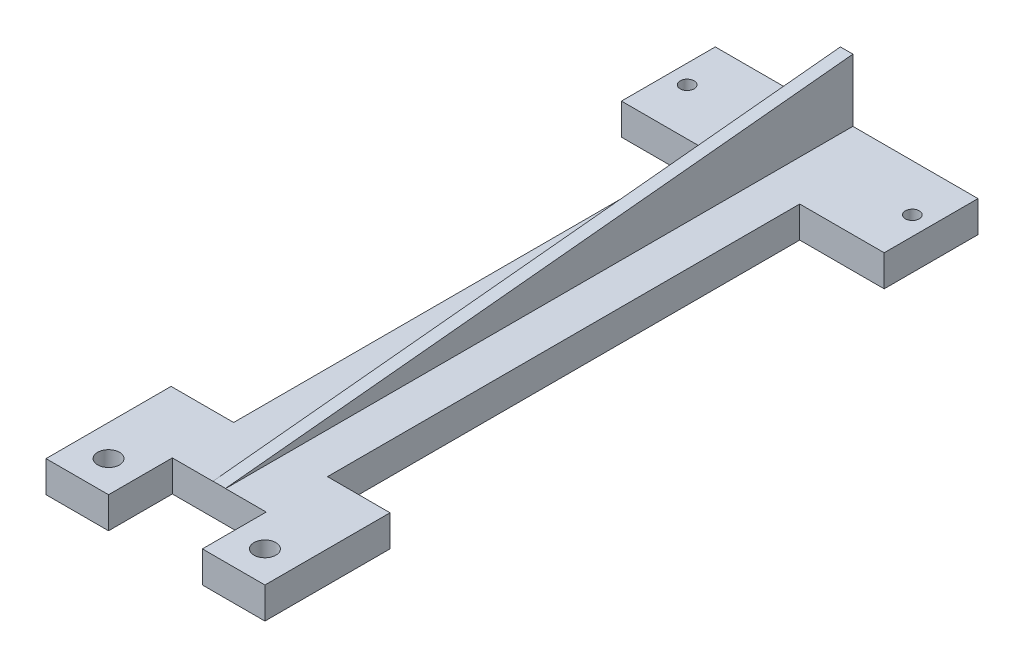
ISO-10303-21;
HEADER;
FILE_DESCRIPTION(('STEP AP214'),'2;1');
FILE_NAME('part.step','',(''),(''),'','','');
FILE_SCHEMA(('AUTOMOTIVE_DESIGN { 1 0 10303 214 1 1 1 1 }'));
ENDSEC;
DATA;
#1=APPLICATION_CONTEXT('core data for automotive mechanical design processes');
#2=APPLICATION_PROTOCOL_DEFINITION('international standard','automotive_design',2000,#1);
#3=PRODUCT_CONTEXT('',#1,'mechanical');
#4=PRODUCT('Part','Part','',(#3));
#5=PRODUCT_RELATED_PRODUCT_CATEGORY('part','',(#4));
#6=PRODUCT_DEFINITION_FORMATION('','',#4);
#7=PRODUCT_DEFINITION_CONTEXT('part definition',#1,'design');
#8=PRODUCT_DEFINITION('design','',#6,#7);
#9=PRODUCT_DEFINITION_SHAPE('','',#8);
#10=(LENGTH_UNIT() NAMED_UNIT(*) SI_UNIT(.MILLI.,.METRE.));
#11=(NAMED_UNIT(*) PLANE_ANGLE_UNIT() SI_UNIT($,.RADIAN.));
#12=(NAMED_UNIT(*) SI_UNIT($,.STERADIAN.) SOLID_ANGLE_UNIT());
#13=UNCERTAINTY_MEASURE_WITH_UNIT(LENGTH_MEASURE(1.E-05),#10,'distance_accuracy_value','');
#14=(GEOMETRIC_REPRESENTATION_CONTEXT(3) GLOBAL_UNCERTAINTY_ASSIGNED_CONTEXT((#13)) GLOBAL_UNIT_ASSIGNED_CONTEXT((#10,
#11,#12)) REPRESENTATION_CONTEXT('',''));
#15=CARTESIAN_POINT('',(0.,0.,0.));
#16=DIRECTION('',(0.,0.,1.));
#17=DIRECTION('',(1.,0.,0.));
#18=AXIS2_PLACEMENT_3D('',#15,#16,#17);
#19=CARTESIAN_POINT('',(0.,5.,0.));
#20=DIRECTION('',(0.,-1.,0.));
#21=DIRECTION('',(0.,0.,-1.));
#22=AXIS2_PLACEMENT_3D('',#19,#20,#21);
#23=PLANE('',#22);
#24=CARTESIAN_POINT('',(3.,5.,-7.5));
#25=DIRECTION('',(0.,1.,0.));
#26=DIRECTION('',(0.,0.,1.));
#27=AXIS2_PLACEMENT_3D('',#24,#25,#26);
#28=CIRCLE('',#27,1.115);
#29=CARTESIAN_POINT('',(3.,5.,-6.385));
#30=VERTEX_POINT('',#29);
#31=EDGE_CURVE('E357',#30,#30,#28,.T.);
#32=ORIENTED_EDGE('',*,*,#31,.F.);
#33=EDGE_LOOP('',(#32));
#34=FACE_BOUND('',#33,.T.);
#35=CARTESIAN_POINT('',(8.50000000000001,5.,90.5));
#36=DIRECTION('',(0.,1.,0.));
#37=DIRECTION('',(0.,0.,1.));
#38=AXIS2_PLACEMENT_3D('',#35,#36,#37);
#39=CIRCLE('',#38,1.75);
#40=CARTESIAN_POINT('',(8.50000000000001,5.,92.25));
#41=VERTEX_POINT('',#40);
#42=EDGE_CURVE('E237',#41,#41,#39,.T.);
#43=ORIENTED_EDGE('',*,*,#42,.F.);
#44=EDGE_LOOP('',(#43));
#45=FACE_BOUND('',#44,.T.);
#46=DIRECTION('',(0.,0.,1.));
#47=VECTOR('',#46,1.);
#48=CARTESIAN_POINT('',(20.,5.,-15.));
#49=LINE('',#48,#47);
#50=CARTESIAN_POINT('',(20.,5.,-15.));
#51=VERTEX_POINT('',#50);
#52=CARTESIAN_POINT('',(20.,5.,85.3));
#53=VERTEX_POINT('',#52);
#54=EDGE_CURVE('E57',#51,#53,#49,.T.);
#55=ORIENTED_EDGE('',*,*,#54,.F.);
#56=DIRECTION('',(-1.,0.,0.));
#57=VECTOR('',#56,1.);
#58=CARTESIAN_POINT('',(0.,5.,-15.));
#59=LINE('',#58,#57);
#60=CARTESIAN_POINT('',(0.,5.,-15.));
#61=VERTEX_POINT('',#60);
#62=EDGE_CURVE('E200',#51,#61,#59,.T.);
#63=ORIENTED_EDGE('',*,*,#62,.T.);
#64=DIRECTION('',(0.,0.,1.));
#65=VECTOR('',#64,1.);
#66=CARTESIAN_POINT('',(0.,5.,0.));
#67=LINE('',#66,#65);
#68=CARTESIAN_POINT('',(0.,5.,0.));
#69=VERTEX_POINT('',#68);
#70=EDGE_CURVE('E368',#61,#69,#67,.T.);
#71=ORIENTED_EDGE('',*,*,#70,.T.);
#72=DIRECTION('',(1.,0.,0.));
#73=VECTOR('',#72,1.);
#74=CARTESIAN_POINT('',(0.,5.,0.));
#75=LINE('',#74,#73);
#76=CARTESIAN_POINT('',(13.5,5.,0.));
#77=VERTEX_POINT('',#76);
#78=EDGE_CURVE('E374',#69,#77,#75,.T.);
#79=ORIENTED_EDGE('',*,*,#78,.T.);
#80=DIRECTION('',(0.,0.,1.));
#81=VECTOR('',#80,1.);
#82=CARTESIAN_POINT('',(13.5,5.,0.));
#83=LINE('',#82,#81);
#84=CARTESIAN_POINT('',(13.5,5.,75.5));
#85=VERTEX_POINT('',#84);
#86=EDGE_CURVE('E307',#77,#85,#83,.T.);
#87=ORIENTED_EDGE('',*,*,#86,.T.);
#88=DIRECTION('',(-1.,0.,0.));
#89=VECTOR('',#88,1.);
#90=CARTESIAN_POINT('',(3.50000000000001,5.,75.5));
#91=LINE('',#90,#89);
#92=CARTESIAN_POINT('',(3.50000000000001,5.,75.5));
#93=VERTEX_POINT('',#92);
#94=EDGE_CURVE('E298',#85,#93,#91,.T.);
#95=ORIENTED_EDGE('',*,*,#94,.T.);
#96=DIRECTION('',(0.,0.,1.));
#97=VECTOR('',#96,1.);
#98=CARTESIAN_POINT('',(3.50000000000001,5.,75.5));
#99=LINE('',#98,#97);
#100=CARTESIAN_POINT('',(3.50000000000001,5.,95.5));
#101=VERTEX_POINT('',#100);
#102=EDGE_CURVE('E292',#93,#101,#99,.T.);
#103=ORIENTED_EDGE('',*,*,#102,.T.);
#104=DIRECTION('',(1.,0.,0.));
#105=VECTOR('',#104,1.);
#106=CARTESIAN_POINT('',(3.50000000000001,5.,95.5));
#107=LINE('',#106,#105);
#108=CARTESIAN_POINT('',(13.5,5.,95.5));
#109=VERTEX_POINT('',#108);
#110=EDGE_CURVE('E267',#101,#109,#107,.T.);
#111=ORIENTED_EDGE('',*,*,#110,.T.);
#112=DIRECTION('',(0.,0.,-1.));
#113=VECTOR('',#112,1.);
#114=CARTESIAN_POINT('',(13.5,5.,85.5));
#115=LINE('',#114,#113);
#116=CARTESIAN_POINT('',(13.5,5.,85.3));
#117=VERTEX_POINT('',#116);
#118=EDGE_CURVE('E271',#109,#117,#115,.T.);
#119=ORIENTED_EDGE('',*,*,#118,.T.);
#120=DIRECTION('',(-1.,0.,0.));
#121=VECTOR('',#120,1.);
#122=CARTESIAN_POINT('',(13.5,5.,85.3));
#123=LINE('',#122,#121);
#124=EDGE_CURVE('E214',#53,#117,#123,.T.);
#125=ORIENTED_EDGE('',*,*,#124,.F.);
#126=EDGE_LOOP('',(#55,#63,#71,#79,#87,#95,#103,#111,#119,#125));
#127=FACE_BOUND('',#126,.T.);
#128=ADVANCED_FACE('F41',(#34,#45,#127),#23,.F.);
#129=CARTESIAN_POINT('',(39.,5.,-7.5));
#130=DIRECTION('',(0.,1.,0.));
#131=DIRECTION('',(0.,0.,1.));
#132=AXIS2_PLACEMENT_3D('',#129,#130,#131);
#133=CIRCLE('',#132,1.115);
#134=CARTESIAN_POINT('',(39.,5.,-6.385));
#135=VERTEX_POINT('',#134);
#136=EDGE_CURVE('E351',#135,#135,#133,.T.);
#137=ORIENTED_EDGE('',*,*,#136,.F.);
#138=EDGE_LOOP('',(#137));
#139=FACE_BOUND('',#138,.T.);
#140=DIRECTION('',(0.,0.,1.));
#141=VECTOR('',#140,1.);
#142=CARTESIAN_POINT('',(28.5,5.,85.5));
#143=LINE('',#142,#141);
#144=CARTESIAN_POINT('',(28.5,5.,85.3));
#145=VERTEX_POINT('',#144);
#146=CARTESIAN_POINT('',(28.5,5.,95.5));
#147=VERTEX_POINT('',#146);
#148=EDGE_CURVE('E236',#145,#147,#143,.T.);
#149=ORIENTED_EDGE('',*,*,#148,.T.);
#150=DIRECTION('',(1.,0.,0.));
#151=VECTOR('',#150,1.);
#152=CARTESIAN_POINT('',(38.5,5.,95.5));
#153=LINE('',#152,#151);
#154=CARTESIAN_POINT('',(38.5,5.,95.5));
#155=VERTEX_POINT('',#154);
#156=EDGE_CURVE('E248',#147,#155,#153,.T.);
#157=ORIENTED_EDGE('',*,*,#156,.T.);
#158=DIRECTION('',(0.,0.,-1.));
#159=VECTOR('',#158,1.);
#160=CARTESIAN_POINT('',(38.5,5.,75.5));
#161=LINE('',#160,#159);
#162=CARTESIAN_POINT('',(38.5,5.,75.5));
#163=VERTEX_POINT('',#162);
#164=EDGE_CURVE('E299',#155,#163,#161,.T.);
#165=ORIENTED_EDGE('',*,*,#164,.T.);
#166=CARTESIAN_POINT('',(28.5,5.,75.5));
#167=VERTEX_POINT('',#166);
#168=EDGE_CURVE('E293',#163,#167,#91,.T.);
#169=ORIENTED_EDGE('',*,*,#168,.T.);
#170=DIRECTION('',(0.,0.,-1.));
#171=VECTOR('',#170,1.);
#172=CARTESIAN_POINT('',(28.5,5.,0.));
#173=LINE('',#172,#171);
#174=CARTESIAN_POINT('',(28.5,5.,0.));
#175=VERTEX_POINT('',#174);
#176=EDGE_CURVE('E324',#167,#175,#173,.T.);
#177=ORIENTED_EDGE('',*,*,#176,.T.);
#178=CARTESIAN_POINT('',(42.,5.,0.));
#179=VERTEX_POINT('',#178);
#180=EDGE_CURVE('E372',#175,#179,#75,.T.);
#181=ORIENTED_EDGE('',*,*,#180,.T.);
#182=DIRECTION('',(0.,0.,-1.));
#183=VECTOR('',#182,1.);
#184=CARTESIAN_POINT('',(42.,5.,0.));
#185=LINE('',#184,#183);
#186=CARTESIAN_POINT('',(42.,5.,-15.));
#187=VERTEX_POINT('',#186);
#188=EDGE_CURVE('E378',#179,#187,#185,.T.);
#189=ORIENTED_EDGE('',*,*,#188,.T.);
#190=CARTESIAN_POINT('',(22.,5.,-15.));
#191=VERTEX_POINT('',#190);
#192=EDGE_CURVE('E381',#187,#191,#59,.T.);
#193=ORIENTED_EDGE('',*,*,#192,.T.);
#194=DIRECTION('',(0.,0.,-1.));
#195=VECTOR('',#194,1.);
#196=CARTESIAN_POINT('',(22.,5.,-15.));
#197=LINE('',#196,#195);
#198=CARTESIAN_POINT('',(22.,5.,85.3));
#199=VERTEX_POINT('',#198);
#200=EDGE_CURVE('E191',#199,#191,#197,.T.);
#201=ORIENTED_EDGE('',*,*,#200,.F.);
#202=EDGE_CURVE('E220',#145,#199,#123,.T.);
#203=ORIENTED_EDGE('',*,*,#202,.F.);
#204=EDGE_LOOP('',(#149,#157,#165,#169,#177,#181,#189,#193,#201,#203));
#205=FACE_BOUND('',#204,.T.);
#206=CARTESIAN_POINT('',(33.5,5.,90.5));
#207=DIRECTION('',(0.,1.,0.));
#208=DIRECTION('',(0.,0.,1.));
#209=AXIS2_PLACEMENT_3D('',#206,#207,#208);
#210=CIRCLE('',#209,1.75);
#211=CARTESIAN_POINT('',(33.5,5.,92.25));
#212=VERTEX_POINT('',#211);
#213=EDGE_CURVE('E228',#212,#212,#210,.T.);
#214=ORIENTED_EDGE('',*,*,#213,.F.);
#215=EDGE_LOOP('',(#214));
#216=FACE_BOUND('',#215,.T.);
#217=ADVANCED_FACE('F447',(#139,#205,#216),#23,.F.);
#218=CARTESIAN_POINT('',(0.,5.,0.));
#219=DIRECTION('',(0.,0.,-1.));
#220=DIRECTION('',(-1.,0.,0.));
#221=AXIS2_PLACEMENT_3D('',#218,#219,#220);
#222=PLANE('',#221);
#223=DIRECTION('',(0.,1.,0.));
#224=VECTOR('',#223,1.);
#225=CARTESIAN_POINT('',(28.5,-76.9756454990798,0.));
#226=LINE('',#225,#224);
#227=CARTESIAN_POINT('',(28.5,0.,0.));
#228=VERTEX_POINT('',#227);
#229=EDGE_CURVE('E340',#228,#175,#226,.T.);
#230=ORIENTED_EDGE('',*,*,#229,.F.);
#231=DIRECTION('',(1.,0.,0.));
#232=VECTOR('',#231,1.);
#233=CARTESIAN_POINT('',(0.,0.,0.));
#234=LINE('',#233,#232);
#235=CARTESIAN_POINT('',(42.,0.,0.));
#236=VERTEX_POINT('',#235);
#237=EDGE_CURVE('E388',#228,#236,#234,.T.);
#238=ORIENTED_EDGE('',*,*,#237,.T.);
#239=DIRECTION('',(0.,-1.,0.));
#240=VECTOR('',#239,1.);
#241=CARTESIAN_POINT('',(42.,5.,0.));
#242=LINE('',#241,#240);
#243=EDGE_CURVE('E50',#179,#236,#242,.T.);
#244=ORIENTED_EDGE('',*,*,#243,.F.);
#245=ORIENTED_EDGE('',*,*,#180,.F.);
#246=EDGE_LOOP('',(#230,#238,#244,#245));
#247=FACE_BOUND('',#246,.T.);
#248=ADVANCED_FACE('F473',(#247),#222,.F.);
#249=CARTESIAN_POINT('',(0.,5.,0.));
#250=DIRECTION('',(1.,0.,0.));
#251=DIRECTION('',(0.,0.,-1.));
#252=AXIS2_PLACEMENT_3D('',#249,#250,#251);
#253=PLANE('',#252);
#254=DIRECTION('',(0.,0.,1.));
#255=VECTOR('',#254,1.);
#256=CARTESIAN_POINT('',(0.,0.,0.));
#257=LINE('',#256,#255);
#258=CARTESIAN_POINT('',(0.,0.,-15.));
#259=VERTEX_POINT('',#258);
#260=CARTESIAN_POINT('',(0.,0.,0.));
#261=VERTEX_POINT('',#260);
#262=EDGE_CURVE('E356',#259,#261,#257,.T.);
#263=ORIENTED_EDGE('',*,*,#262,.T.);
#264=DIRECTION('',(0.,-1.,0.));
#265=VECTOR('',#264,1.);
#266=CARTESIAN_POINT('',(0.,5.,0.));
#267=LINE('',#266,#265);
#268=EDGE_CURVE('E11',#69,#261,#267,.T.);
#269=ORIENTED_EDGE('',*,*,#268,.F.);
#270=ORIENTED_EDGE('',*,*,#70,.F.);
#271=DIRECTION('',(0.,-1.,0.));
#272=VECTOR('',#271,1.);
#273=CARTESIAN_POINT('',(0.,5.,-15.));
#274=LINE('',#273,#272);
#275=EDGE_CURVE('E384',#61,#259,#274,.T.);
#276=ORIENTED_EDGE('',*,*,#275,.T.);
#277=EDGE_LOOP('',(#263,#269,#270,#276));
#278=FACE_BOUND('',#277,.T.);
#279=ADVANCED_FACE('F43',(#278),#253,.F.);
#280=CARTESIAN_POINT('',(13.5,0.,0.));
#281=VERTEX_POINT('',#280);
#282=EDGE_CURVE('E389',#261,#281,#234,.T.);
#283=ORIENTED_EDGE('',*,*,#282,.T.);
#284=DIRECTION('',(0.,1.,0.));
#285=VECTOR('',#284,1.);
#286=CARTESIAN_POINT('',(13.5,-76.9756454990798,0.));
#287=LINE('',#286,#285);
#288=EDGE_CURVE('E336',#281,#77,#287,.T.);
#289=ORIENTED_EDGE('',*,*,#288,.T.);
#290=ORIENTED_EDGE('',*,*,#78,.F.);
#291=ORIENTED_EDGE('',*,*,#268,.T.);
#292=EDGE_LOOP('',(#283,#289,#290,#291));
#293=FACE_BOUND('',#292,.T.);
#294=ADVANCED_FACE('F486',(#293),#222,.F.);
#295=CARTESIAN_POINT('',(42.,5.,0.));
#296=DIRECTION('',(-1.,0.,0.));
#297=DIRECTION('',(0.,0.,1.));
#298=AXIS2_PLACEMENT_3D('',#295,#296,#297);
#299=PLANE('',#298);
#300=DIRECTION('',(0.,0.,-1.));
#301=VECTOR('',#300,1.);
#302=CARTESIAN_POINT('',(42.,0.,0.));
#303=LINE('',#302,#301);
#304=CARTESIAN_POINT('',(42.,0.,-15.));
#305=VERTEX_POINT('',#304);
#306=EDGE_CURVE('E393',#236,#305,#303,.T.);
#307=ORIENTED_EDGE('',*,*,#306,.T.);
#308=DIRECTION('',(0.,-1.,0.));
#309=VECTOR('',#308,1.);
#310=CARTESIAN_POINT('',(42.,5.,-15.));
#311=LINE('',#310,#309);
#312=EDGE_CURVE('E401',#187,#305,#311,.T.);
#313=ORIENTED_EDGE('',*,*,#312,.F.);
#314=ORIENTED_EDGE('',*,*,#188,.F.);
#315=ORIENTED_EDGE('',*,*,#243,.T.);
#316=EDGE_LOOP('',(#307,#313,#314,#315));
#317=FACE_BOUND('',#316,.T.);
#318=ADVANCED_FACE('F410',(#317),#299,.F.);
#319=CARTESIAN_POINT('',(0.,5.,-15.));
#320=DIRECTION('',(0.,0.,1.));
#321=DIRECTION('',(1.,0.,0.));
#322=AXIS2_PLACEMENT_3D('',#319,#320,#321);
#323=PLANE('',#322);
#324=DIRECTION('',(-1.,0.,0.));
#325=VECTOR('',#324,1.);
#326=CARTESIAN_POINT('',(0.,0.,-15.));
#327=LINE('',#326,#325);
#328=EDGE_CURVE('E373',#305,#259,#327,.T.);
#329=ORIENTED_EDGE('',*,*,#328,.T.);
#330=ORIENTED_EDGE('',*,*,#275,.F.);
#331=ORIENTED_EDGE('',*,*,#62,.F.);
#332=DIRECTION('',(0.,-1.,0.));
#333=VECTOR('',#332,1.);
#334=CARTESIAN_POINT('',(20.,15.,-15.));
#335=LINE('',#334,#333);
#336=CARTESIAN_POINT('',(20.,15.,-15.));
#337=VERTEX_POINT('',#336);
#338=EDGE_CURVE('E190',#337,#51,#335,.T.);
#339=ORIENTED_EDGE('',*,*,#338,.F.);
#340=DIRECTION('',(-1.,0.,0.));
#341=VECTOR('',#340,1.);
#342=CARTESIAN_POINT('',(20.,15.,-15.));
#343=LINE('',#342,#341);
#344=CARTESIAN_POINT('',(22.,15.,-15.));
#345=VERTEX_POINT('',#344);
#346=EDGE_CURVE('E179',#345,#337,#343,.T.);
#347=ORIENTED_EDGE('',*,*,#346,.F.);
#348=DIRECTION('',(0.,-1.,0.));
#349=VECTOR('',#348,1.);
#350=CARTESIAN_POINT('',(22.,15.,-15.));
#351=LINE('',#350,#349);
#352=EDGE_CURVE('E202',#345,#191,#351,.T.);
#353=ORIENTED_EDGE('',*,*,#352,.T.);
#354=ORIENTED_EDGE('',*,*,#192,.F.);
#355=ORIENTED_EDGE('',*,*,#312,.T.);
#356=EDGE_LOOP('',(#329,#330,#331,#339,#347,#353,#354,#355));
#357=FACE_BOUND('',#356,.T.);
#358=ADVANCED_FACE('F198',(#357),#323,.F.);
#359=CARTESIAN_POINT('',(0.,0.,0.));
#360=DIRECTION('',(0.,-1.,0.));
#361=DIRECTION('',(0.,0.,-1.));
#362=AXIS2_PLACEMENT_3D('',#359,#360,#361);
#363=PLANE('',#362);
#364=DIRECTION('',(-1.,0.,0.));
#365=VECTOR('',#364,1.);
#366=CARTESIAN_POINT('',(13.5,0.,85.3));
#367=LINE('',#366,#365);
#368=CARTESIAN_POINT('',(28.5,0.,85.3));
#369=VERTEX_POINT('',#368);
#370=CARTESIAN_POINT('',(13.5,0.,85.3));
#371=VERTEX_POINT('',#370);
#372=EDGE_CURVE('E215',#369,#371,#367,.T.);
#373=ORIENTED_EDGE('',*,*,#372,.T.);
#374=DIRECTION('',(0.,0.,-1.));
#375=VECTOR('',#374,1.);
#376=CARTESIAN_POINT('',(13.5,0.,85.5));
#377=LINE('',#376,#375);
#378=CARTESIAN_POINT('',(13.5,0.,95.5));
#379=VERTEX_POINT('',#378);
#380=EDGE_CURVE('E283',#379,#371,#377,.T.);
#381=ORIENTED_EDGE('',*,*,#380,.F.);
#382=DIRECTION('',(1.,0.,0.));
#383=VECTOR('',#382,1.);
#384=CARTESIAN_POINT('',(3.50000000000001,0.,95.5));
#385=LINE('',#384,#383);
#386=CARTESIAN_POINT('',(3.50000000000001,0.,95.5));
#387=VERTEX_POINT('',#386);
#388=EDGE_CURVE('E275',#387,#379,#385,.T.);
#389=ORIENTED_EDGE('',*,*,#388,.F.);
#390=DIRECTION('',(0.,0.,1.));
#391=VECTOR('',#390,1.);
#392=CARTESIAN_POINT('',(3.50000000000001,0.,75.5));
#393=LINE('',#392,#391);
#394=CARTESIAN_POINT('',(3.50000000000001,0.,75.5));
#395=VERTEX_POINT('',#394);
#396=EDGE_CURVE('E304',#395,#387,#393,.T.);
#397=ORIENTED_EDGE('',*,*,#396,.F.);
#398=DIRECTION('',(-1.,0.,0.));
#399=VECTOR('',#398,1.);
#400=CARTESIAN_POINT('',(3.50000000000001,0.,75.5));
#401=LINE('',#400,#399);
#402=CARTESIAN_POINT('',(13.5,0.,75.5));
#403=VERTEX_POINT('',#402);
#404=EDGE_CURVE('E313',#403,#395,#401,.T.);
#405=ORIENTED_EDGE('',*,*,#404,.F.);
#406=DIRECTION('',(0.,0.,1.));
#407=VECTOR('',#406,1.);
#408=CARTESIAN_POINT('',(13.5,0.,0.));
#409=LINE('',#408,#407);
#410=EDGE_CURVE('E332',#281,#403,#409,.T.);
#411=ORIENTED_EDGE('',*,*,#410,.F.);
#412=ORIENTED_EDGE('',*,*,#282,.F.);
#413=ORIENTED_EDGE('',*,*,#262,.F.);
#414=ORIENTED_EDGE('',*,*,#328,.F.);
#415=ORIENTED_EDGE('',*,*,#306,.F.);
#416=ORIENTED_EDGE('',*,*,#237,.F.);
#417=DIRECTION('',(0.,0.,-1.));
#418=VECTOR('',#417,1.);
#419=CARTESIAN_POINT('',(28.5,0.,0.));
#420=LINE('',#419,#418);
#421=CARTESIAN_POINT('',(28.5,0.,75.5));
#422=VERTEX_POINT('',#421);
#423=EDGE_CURVE('E337',#422,#228,#420,.T.);
#424=ORIENTED_EDGE('',*,*,#423,.F.);
#425=CARTESIAN_POINT('',(38.5,0.,75.5));
#426=VERTEX_POINT('',#425);
#427=EDGE_CURVE('E309',#426,#422,#401,.T.);
#428=ORIENTED_EDGE('',*,*,#427,.F.);
#429=DIRECTION('',(0.,0.,-1.));
#430=VECTOR('',#429,1.);
#431=CARTESIAN_POINT('',(38.5,0.,75.5));
#432=LINE('',#431,#430);
#433=CARTESIAN_POINT('',(38.5,0.,95.5));
#434=VERTEX_POINT('',#433);
#435=EDGE_CURVE('E297',#434,#426,#432,.T.);
#436=ORIENTED_EDGE('',*,*,#435,.F.);
#437=DIRECTION('',(1.,0.,0.));
#438=VECTOR('',#437,1.);
#439=CARTESIAN_POINT('',(38.5,0.,95.5));
#440=LINE('',#439,#438);
#441=CARTESIAN_POINT('',(28.5,0.,95.5));
#442=VERTEX_POINT('',#441);
#443=EDGE_CURVE('E255',#442,#434,#440,.T.);
#444=ORIENTED_EDGE('',*,*,#443,.F.);
#445=DIRECTION('',(0.,0.,1.));
#446=VECTOR('',#445,1.);
#447=CARTESIAN_POINT('',(28.5,0.,85.5));
#448=LINE('',#447,#446);
#449=EDGE_CURVE('E252',#369,#442,#448,.T.);
#450=ORIENTED_EDGE('',*,*,#449,.F.);
#451=EDGE_LOOP('',(#373,#381,#389,#397,#405,#411,#412,#413,#414,#415,#416,#424,#428,#436,#444,#450));
#452=FACE_BOUND('',#451,.T.);
#453=CARTESIAN_POINT('',(8.50000000000001,0.,90.5));
#454=DIRECTION('',(0.,1.,0.));
#455=DIRECTION('',(0.,0.,1.));
#456=AXIS2_PLACEMENT_3D('',#453,#454,#455);
#457=CIRCLE('',#456,1.75);
#458=CARTESIAN_POINT('',(8.50000000000001,0.,92.25));
#459=VERTEX_POINT('',#458);
#460=EDGE_CURVE('E232',#459,#459,#457,.T.);
#461=ORIENTED_EDGE('',*,*,#460,.T.);
#462=EDGE_LOOP('',(#461));
#463=FACE_BOUND('',#462,.T.);
#464=CARTESIAN_POINT('',(33.5,0.,90.5));
#465=DIRECTION('',(0.,1.,0.));
#466=DIRECTION('',(0.,0.,1.));
#467=AXIS2_PLACEMENT_3D('',#464,#465,#466);
#468=CIRCLE('',#467,1.75);
#469=CARTESIAN_POINT('',(33.5,0.,92.25));
#470=VERTEX_POINT('',#469);
#471=EDGE_CURVE('E241',#470,#470,#468,.T.);
#472=ORIENTED_EDGE('',*,*,#471,.T.);
#473=EDGE_LOOP('',(#472));
#474=FACE_BOUND('',#473,.T.);
#475=CARTESIAN_POINT('',(3.,0.,-7.5));
#476=DIRECTION('',(0.,1.,0.));
#477=DIRECTION('',(0.,0.,1.));
#478=AXIS2_PLACEMENT_3D('',#475,#476,#477);
#479=CIRCLE('',#478,1.115);
#480=CARTESIAN_POINT('',(3.,0.,-6.385));
#481=VERTEX_POINT('',#480);
#482=EDGE_CURVE('E352',#481,#481,#479,.T.);
#483=ORIENTED_EDGE('',*,*,#482,.T.);
#484=EDGE_LOOP('',(#483));
#485=FACE_BOUND('',#484,.T.);
#486=CARTESIAN_POINT('',(39.,0.,-7.5));
#487=DIRECTION('',(0.,1.,0.));
#488=DIRECTION('',(0.,0.,1.));
#489=AXIS2_PLACEMENT_3D('',#486,#487,#488);
#490=CIRCLE('',#489,1.115);
#491=CARTESIAN_POINT('',(39.,0.,-6.385));
#492=VERTEX_POINT('',#491);
#493=EDGE_CURVE('E361',#492,#492,#490,.T.);
#494=ORIENTED_EDGE('',*,*,#493,.T.);
#495=EDGE_LOOP('',(#494));
#496=FACE_BOUND('',#495,.T.);
#497=ADVANCED_FACE('F417',(#452,#463,#474,#485,#496),#363,.T.);
#498=CARTESIAN_POINT('',(39.,0.,-7.5));
#499=DIRECTION('',(0.,1.,0.));
#500=DIRECTION('',(0.,0.,1.));
#501=AXIS2_PLACEMENT_3D('',#498,#499,#500);
#502=CYLINDRICAL_SURFACE('',#501,1.115);
#503=ORIENTED_EDGE('',*,*,#493,.F.);
#504=EDGE_LOOP('',(#503));
#505=FACE_BOUND('',#504,.T.);
#506=ORIENTED_EDGE('',*,*,#136,.T.);
#507=EDGE_LOOP('',(#506));
#508=FACE_BOUND('',#507,.T.);
#509=ADVANCED_FACE('F479',(#505,#508),#502,.F.);
#510=CARTESIAN_POINT('',(3.,0.,-7.5));
#511=DIRECTION('',(0.,1.,0.));
#512=DIRECTION('',(0.,0.,1.));
#513=AXIS2_PLACEMENT_3D('',#510,#511,#512);
#514=CYLINDRICAL_SURFACE('',#513,1.115);
#515=ORIENTED_EDGE('',*,*,#482,.F.);
#516=EDGE_LOOP('',(#515));
#517=FACE_BOUND('',#516,.T.);
#518=ORIENTED_EDGE('',*,*,#31,.T.);
#519=EDGE_LOOP('',(#518));
#520=FACE_BOUND('',#519,.T.);
#521=ADVANCED_FACE('F540',(#517,#520),#514,.F.);
#522=CARTESIAN_POINT('',(28.5,-76.9756454990798,0.));
#523=DIRECTION('',(1.,0.,0.));
#524=DIRECTION('',(0.,0.,-1.));
#525=AXIS2_PLACEMENT_3D('',#522,#523,#524);
#526=PLANE('',#525);
#527=DIRECTION('',(0.,1.,0.));
#528=VECTOR('',#527,1.);
#529=CARTESIAN_POINT('',(28.5,-76.9756454990798,75.5));
#530=LINE('',#529,#528);
#531=EDGE_CURVE('E328',#422,#167,#530,.T.);
#532=ORIENTED_EDGE('',*,*,#531,.F.);
#533=ORIENTED_EDGE('',*,*,#423,.T.);
#534=ORIENTED_EDGE('',*,*,#229,.T.);
#535=ORIENTED_EDGE('',*,*,#176,.F.);
#536=EDGE_LOOP('',(#532,#533,#534,#535));
#537=FACE_BOUND('',#536,.T.);
#538=ADVANCED_FACE('F498',(#537),#526,.T.);
#539=CARTESIAN_POINT('',(13.5,-76.9756454990798,0.));
#540=DIRECTION('',(-1.,0.,0.));
#541=DIRECTION('',(0.,0.,1.));
#542=AXIS2_PLACEMENT_3D('',#539,#540,#541);
#543=PLANE('',#542);
#544=ORIENTED_EDGE('',*,*,#288,.F.);
#545=ORIENTED_EDGE('',*,*,#410,.T.);
#546=DIRECTION('',(0.,1.,0.));
#547=VECTOR('',#546,1.);
#548=CARTESIAN_POINT('',(13.5,-76.9756454990798,75.5));
#549=LINE('',#548,#547);
#550=EDGE_CURVE('E335',#403,#85,#549,.T.);
#551=ORIENTED_EDGE('',*,*,#550,.T.);
#552=ORIENTED_EDGE('',*,*,#86,.F.);
#553=EDGE_LOOP('',(#544,#545,#551,#552));
#554=FACE_BOUND('',#553,.T.);
#555=ADVANCED_FACE('F535',(#554),#543,.T.);
#556=CARTESIAN_POINT('',(3.50000000000001,-36.4005494464026,75.5));
#557=DIRECTION('',(0.,0.,-1.));
#558=DIRECTION('',(-1.,0.,0.));
#559=AXIS2_PLACEMENT_3D('',#556,#557,#558);
#560=PLANE('',#559);
#561=ORIENTED_EDGE('',*,*,#550,.F.);
#562=ORIENTED_EDGE('',*,*,#404,.T.);
#563=DIRECTION('',(0.,1.,0.));
#564=VECTOR('',#563,1.);
#565=CARTESIAN_POINT('',(3.50000000000001,-36.4005494464026,75.5));
#566=LINE('',#565,#564);
#567=EDGE_CURVE('E308',#395,#93,#566,.T.);
#568=ORIENTED_EDGE('',*,*,#567,.T.);
#569=ORIENTED_EDGE('',*,*,#94,.F.);
#570=EDGE_LOOP('',(#561,#562,#568,#569));
#571=FACE_BOUND('',#570,.T.);
#572=ADVANCED_FACE('F532',(#571),#560,.T.);
#573=CARTESIAN_POINT('',(38.5,-36.4005494464026,75.5));
#574=DIRECTION('',(1.,0.,0.));
#575=DIRECTION('',(0.,0.,-1.));
#576=AXIS2_PLACEMENT_3D('',#573,#574,#575);
#577=PLANE('',#576);
#578=ORIENTED_EDGE('',*,*,#164,.F.);
#579=DIRECTION('',(0.,1.,0.));
#580=VECTOR('',#579,1.);
#581=CARTESIAN_POINT('',(38.5,-14.142135623731,95.5));
#582=LINE('',#581,#580);
#583=EDGE_CURVE('E259',#434,#155,#582,.T.);
#584=ORIENTED_EDGE('',*,*,#583,.F.);
#585=ORIENTED_EDGE('',*,*,#435,.T.);
#586=DIRECTION('',(0.,1.,0.));
#587=VECTOR('',#586,1.);
#588=CARTESIAN_POINT('',(38.5,-36.4005494464026,75.5));
#589=LINE('',#588,#587);
#590=EDGE_CURVE('E317',#426,#163,#589,.T.);
#591=ORIENTED_EDGE('',*,*,#590,.T.);
#592=EDGE_LOOP('',(#578,#584,#585,#591));
#593=FACE_BOUND('',#592,.T.);
#594=ADVANCED_FACE('F506',(#593),#577,.T.);
#595=ORIENTED_EDGE('',*,*,#427,.T.);
#596=ORIENTED_EDGE('',*,*,#531,.T.);
#597=ORIENTED_EDGE('',*,*,#168,.F.);
#598=ORIENTED_EDGE('',*,*,#590,.F.);
#599=EDGE_LOOP('',(#595,#596,#597,#598));
#600=FACE_BOUND('',#599,.T.);
#601=ADVANCED_FACE('F502',(#600),#560,.T.);
#602=CARTESIAN_POINT('',(3.50000000000001,-36.4005494464026,75.5));
#603=DIRECTION('',(-1.,0.,0.));
#604=DIRECTION('',(0.,0.,1.));
#605=AXIS2_PLACEMENT_3D('',#602,#603,#604);
#606=PLANE('',#605);
#607=ORIENTED_EDGE('',*,*,#567,.F.);
#608=ORIENTED_EDGE('',*,*,#396,.T.);
#609=DIRECTION('',(0.,1.,0.));
#610=VECTOR('',#609,1.);
#611=CARTESIAN_POINT('',(3.50000000000001,-14.142135623731,95.5));
#612=LINE('',#611,#610);
#613=EDGE_CURVE('E286',#387,#101,#612,.T.);
#614=ORIENTED_EDGE('',*,*,#613,.T.);
#615=ORIENTED_EDGE('',*,*,#102,.F.);
#616=EDGE_LOOP('',(#607,#608,#614,#615));
#617=FACE_BOUND('',#616,.T.);
#618=ADVANCED_FACE('F525',(#617),#606,.T.);
#619=CARTESIAN_POINT('',(3.50000000000001,-14.142135623731,95.5));
#620=DIRECTION('',(0.,0.,1.));
#621=DIRECTION('',(1.,0.,0.));
#622=AXIS2_PLACEMENT_3D('',#619,#620,#621);
#623=PLANE('',#622);
#624=ORIENTED_EDGE('',*,*,#613,.F.);
#625=ORIENTED_EDGE('',*,*,#388,.T.);
#626=DIRECTION('',(0.,1.,0.));
#627=VECTOR('',#626,1.);
#628=CARTESIAN_POINT('',(13.5,-14.142135623731,95.5));
#629=LINE('',#628,#627);
#630=EDGE_CURVE('E282',#379,#109,#629,.T.);
#631=ORIENTED_EDGE('',*,*,#630,.T.);
#632=ORIENTED_EDGE('',*,*,#110,.F.);
#633=EDGE_LOOP('',(#624,#625,#631,#632));
#634=FACE_BOUND('',#633,.T.);
#635=ADVANCED_FACE('F519',(#634),#623,.T.);
#636=CARTESIAN_POINT('',(13.5,-14.142135623731,85.5));
#637=DIRECTION('',(1.,0.,0.));
#638=DIRECTION('',(0.,0.,-1.));
#639=AXIS2_PLACEMENT_3D('',#636,#637,#638);
#640=PLANE('',#639);
#641=ORIENTED_EDGE('',*,*,#630,.F.);
#642=ORIENTED_EDGE('',*,*,#380,.T.);
#643=DIRECTION('',(0.,1.,0.));
#644=VECTOR('',#643,1.);
#645=CARTESIAN_POINT('',(13.5,0.,85.3));
#646=LINE('',#645,#644);
#647=EDGE_CURVE('E224',#371,#117,#646,.T.);
#648=ORIENTED_EDGE('',*,*,#647,.T.);
#649=ORIENTED_EDGE('',*,*,#118,.F.);
#650=EDGE_LOOP('',(#641,#642,#648,#649));
#651=FACE_BOUND('',#650,.T.);
#652=ADVANCED_FACE('F438',(#651),#640,.T.);
#653=CARTESIAN_POINT('',(28.5,-14.142135623731,85.5));
#654=DIRECTION('',(-1.,0.,0.));
#655=DIRECTION('',(0.,0.,1.));
#656=AXIS2_PLACEMENT_3D('',#653,#654,#655);
#657=PLANE('',#656);
#658=ORIENTED_EDGE('',*,*,#148,.F.);
#659=DIRECTION('',(0.,1.,0.));
#660=VECTOR('',#659,1.);
#661=CARTESIAN_POINT('',(28.5,0.,85.3));
#662=LINE('',#661,#660);
#663=EDGE_CURVE('E219',#369,#145,#662,.T.);
#664=ORIENTED_EDGE('',*,*,#663,.F.);
#665=ORIENTED_EDGE('',*,*,#449,.T.);
#666=DIRECTION('',(0.,1.,0.));
#667=VECTOR('',#666,1.);
#668=CARTESIAN_POINT('',(28.5,-14.142135623731,95.5));
#669=LINE('',#668,#667);
#670=EDGE_CURVE('E260',#442,#147,#669,.T.);
#671=ORIENTED_EDGE('',*,*,#670,.T.);
#672=EDGE_LOOP('',(#658,#664,#665,#671));
#673=FACE_BOUND('',#672,.T.);
#674=ADVANCED_FACE('F510',(#673),#657,.T.);
#675=CARTESIAN_POINT('',(38.5,-14.142135623731,95.5));
#676=DIRECTION('',(0.,0.,1.));
#677=DIRECTION('',(1.,0.,0.));
#678=AXIS2_PLACEMENT_3D('',#675,#676,#677);
#679=PLANE('',#678);
#680=ORIENTED_EDGE('',*,*,#670,.F.);
#681=ORIENTED_EDGE('',*,*,#443,.T.);
#682=ORIENTED_EDGE('',*,*,#583,.T.);
#683=ORIENTED_EDGE('',*,*,#156,.F.);
#684=EDGE_LOOP('',(#680,#681,#682,#683));
#685=FACE_BOUND('',#684,.T.);
#686=ADVANCED_FACE('F509',(#685),#679,.T.);
#687=CARTESIAN_POINT('',(33.5,0.,90.5));
#688=DIRECTION('',(0.,1.,0.));
#689=DIRECTION('',(0.,0.,1.));
#690=AXIS2_PLACEMENT_3D('',#687,#688,#689);
#691=CYLINDRICAL_SURFACE('',#690,1.75);
#692=ORIENTED_EDGE('',*,*,#471,.F.);
#693=EDGE_LOOP('',(#692));
#694=FACE_BOUND('',#693,.T.);
#695=ORIENTED_EDGE('',*,*,#213,.T.);
#696=EDGE_LOOP('',(#695));
#697=FACE_BOUND('',#696,.T.);
#698=ADVANCED_FACE('F517',(#694,#697),#691,.F.);
#699=CARTESIAN_POINT('',(8.50000000000001,0.,90.5));
#700=DIRECTION('',(0.,1.,0.));
#701=DIRECTION('',(0.,0.,1.));
#702=AXIS2_PLACEMENT_3D('',#699,#700,#701);
#703=CYLINDRICAL_SURFACE('',#702,1.75);
#704=ORIENTED_EDGE('',*,*,#460,.F.);
#705=EDGE_LOOP('',(#704));
#706=FACE_BOUND('',#705,.T.);
#707=ORIENTED_EDGE('',*,*,#42,.T.);
#708=EDGE_LOOP('',(#707));
#709=FACE_BOUND('',#708,.T.);
#710=ADVANCED_FACE('F644',(#706,#709),#703,.F.);
#711=CARTESIAN_POINT('',(13.5,0.,85.3));
#712=DIRECTION('',(0.,0.,-1.));
#713=DIRECTION('',(-1.,0.,0.));
#714=AXIS2_PLACEMENT_3D('',#711,#712,#713);
#715=PLANE('',#714);
#716=DIRECTION('',(0.,-1.,0.));
#717=VECTOR('',#716,1.);
#718=CARTESIAN_POINT('',(22.,15.,85.3));
#719=LINE('',#718,#717);
#720=CARTESIAN_POINT('',(22.,5.01990049751244,85.3));
#721=VERTEX_POINT('',#720);
#722=EDGE_CURVE('E205',#721,#199,#719,.T.);
#723=ORIENTED_EDGE('',*,*,#722,.F.);
#724=DIRECTION('',(-1.,0.,0.));
#725=VECTOR('',#724,1.);
#726=CARTESIAN_POINT('',(13.5,5.01990049751244,85.3));
#727=LINE('',#726,#725);
#728=CARTESIAN_POINT('',(20.,5.01990049751244,85.3));
#729=VERTEX_POINT('',#728);
#730=EDGE_CURVE('E453',#721,#729,#727,.T.);
#731=ORIENTED_EDGE('',*,*,#730,.T.);
#732=DIRECTION('',(0.,-1.,0.));
#733=VECTOR('',#732,1.);
#734=CARTESIAN_POINT('',(20.,15.,85.3));
#735=LINE('',#734,#733);
#736=EDGE_CURVE('E65',#729,#53,#735,.T.);
#737=ORIENTED_EDGE('',*,*,#736,.T.);
#738=ORIENTED_EDGE('',*,*,#124,.T.);
#739=ORIENTED_EDGE('',*,*,#647,.F.);
#740=ORIENTED_EDGE('',*,*,#372,.F.);
#741=ORIENTED_EDGE('',*,*,#663,.T.);
#742=ORIENTED_EDGE('',*,*,#202,.T.);
#743=EDGE_LOOP('',(#723,#731,#737,#738,#739,#740,#741,#742));
#744=FACE_BOUND('',#743,.T.);
#745=ADVANCED_FACE('F432',(#744),#715,.F.);
#746=CARTESIAN_POINT('',(20.,15.,-15.));
#747=DIRECTION('',(1.,0.,0.));
#748=DIRECTION('',(0.,0.,-1.));
#749=AXIS2_PLACEMENT_3D('',#746,#747,#748);
#750=PLANE('',#749);
#751=ORIENTED_EDGE('',*,*,#736,.F.);
#752=DIRECTION('',(0.,-0.0990135409038658,0.995086086083852));
#753=VECTOR('',#752,1.);
#754=CARTESIAN_POINT('',(20.,15.,-15.));
#755=LINE('',#754,#753);
#756=EDGE_CURVE('E182',#337,#729,#755,.T.);
#757=ORIENTED_EDGE('',*,*,#756,.F.);
#758=ORIENTED_EDGE('',*,*,#338,.T.);
#759=ORIENTED_EDGE('',*,*,#54,.T.);
#760=EDGE_LOOP('',(#751,#757,#758,#759));
#761=FACE_BOUND('',#760,.T.);
#762=ADVANCED_FACE('F195',(#761),#750,.F.);
#763=CARTESIAN_POINT('',(22.,15.,-15.));
#764=DIRECTION('',(-1.,0.,0.));
#765=DIRECTION('',(0.,0.,1.));
#766=AXIS2_PLACEMENT_3D('',#763,#764,#765);
#767=PLANE('',#766);
#768=ORIENTED_EDGE('',*,*,#352,.F.);
#769=DIRECTION('',(0.,-0.0990135409038658,0.995086086083852));
#770=VECTOR('',#769,1.);
#771=CARTESIAN_POINT('',(22.,15.,-15.));
#772=LINE('',#771,#770);
#773=EDGE_CURVE('E184',#345,#721,#772,.T.);
#774=ORIENTED_EDGE('',*,*,#773,.T.);
#775=ORIENTED_EDGE('',*,*,#722,.T.);
#776=ORIENTED_EDGE('',*,*,#200,.T.);
#777=EDGE_LOOP('',(#768,#774,#775,#776));
#778=FACE_BOUND('',#777,.T.);
#779=ADVANCED_FACE('F458',(#778),#767,.F.);
#780=CARTESIAN_POINT('',(42.,15.,-15.));
#781=DIRECTION('',(0.,-0.995086086083852,-0.0990135409038658));
#782=DIRECTION('',(0.,0.0990135409038658,-0.995086086083852));
#783=AXIS2_PLACEMENT_3D('',#780,#781,#782);
#784=PLANE('',#783);
#785=ORIENTED_EDGE('',*,*,#773,.F.);
#786=ORIENTED_EDGE('',*,*,#346,.T.);
#787=ORIENTED_EDGE('',*,*,#756,.T.);
#788=ORIENTED_EDGE('',*,*,#730,.F.);
#789=EDGE_LOOP('',(#785,#786,#787,#788));
#790=FACE_BOUND('',#789,.T.);
#791=ADVANCED_FACE('F181',(#790),#784,.F.);
#792=CLOSED_SHELL('',(#128,#217,#248,#279,#294,#318,#358,#497,#509,#521,#538,#555,#572,#594,
#601,#618,#635,#652,#674,#686,#698,#710,#745,#762,#779,#791));
#793=MANIFOLD_SOLID_BREP('B2',#792);
#794=ADVANCED_BREP_SHAPE_REPRESENTATION('',(#18,#793),#14);
#795=SHAPE_DEFINITION_REPRESENTATION(#9,#794);
ENDSEC;
END-ISO-10303-21;
